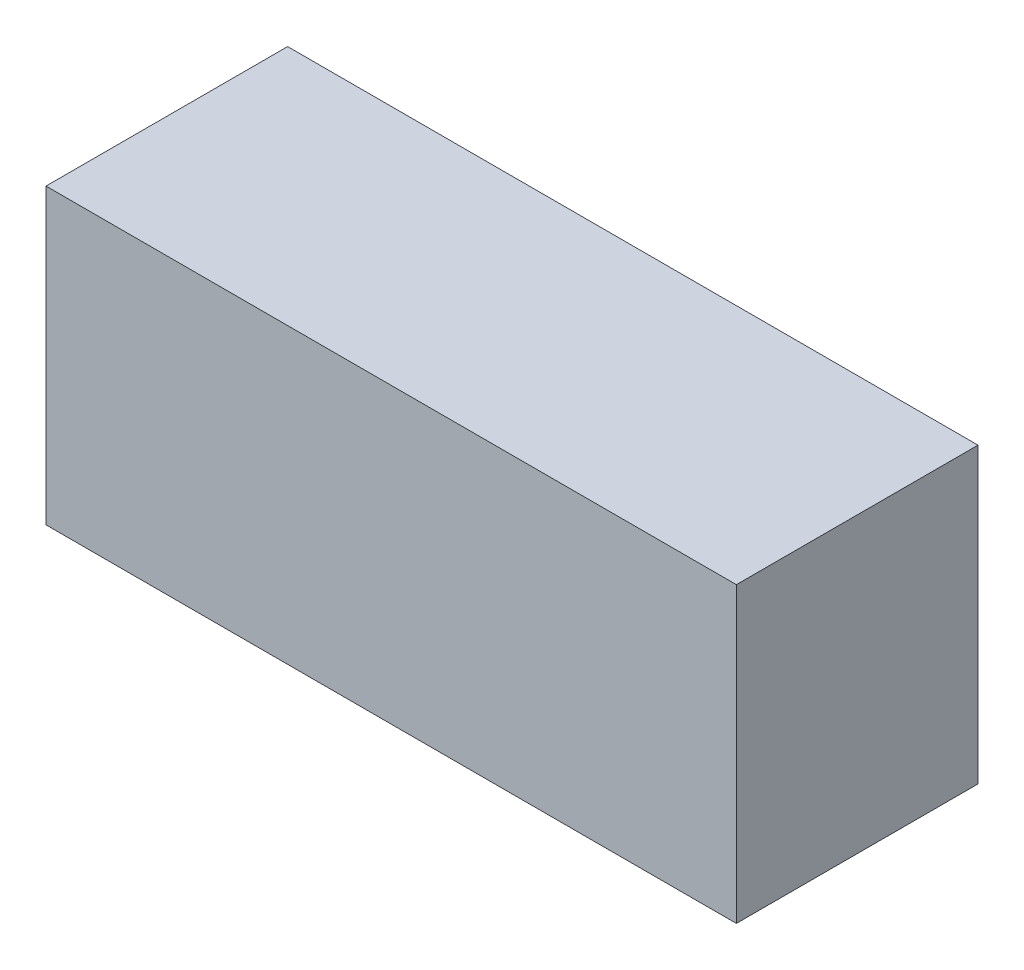
ISO-10303-21;
HEADER;
FILE_DESCRIPTION(('STEP AP214'),'2;1');
FILE_NAME('part.step','',(''),(''),'','','');
FILE_SCHEMA(('AUTOMOTIVE_DESIGN { 1 0 10303 214 1 1 1 1 }'));
ENDSEC;
DATA;
#1=APPLICATION_CONTEXT('core data for automotive mechanical design processes');
#2=APPLICATION_PROTOCOL_DEFINITION('international standard','automotive_design',2000,#1);
#3=PRODUCT_CONTEXT('',#1,'mechanical');
#4=PRODUCT('Part','Part','',(#3));
#5=PRODUCT_RELATED_PRODUCT_CATEGORY('part','',(#4));
#6=PRODUCT_DEFINITION_FORMATION('','',#4);
#7=PRODUCT_DEFINITION_CONTEXT('part definition',#1,'design');
#8=PRODUCT_DEFINITION('design','',#6,#7);
#9=PRODUCT_DEFINITION_SHAPE('','',#8);
#10=(LENGTH_UNIT() NAMED_UNIT(*) SI_UNIT(.MILLI.,.METRE.));
#11=(NAMED_UNIT(*) PLANE_ANGLE_UNIT() SI_UNIT($,.RADIAN.));
#12=(NAMED_UNIT(*) SI_UNIT($,.STERADIAN.) SOLID_ANGLE_UNIT());
#13=UNCERTAINTY_MEASURE_WITH_UNIT(LENGTH_MEASURE(1.E-05),#10,'distance_accuracy_value','');
#14=(GEOMETRIC_REPRESENTATION_CONTEXT(3) GLOBAL_UNCERTAINTY_ASSIGNED_CONTEXT((#13)) GLOBAL_UNIT_ASSIGNED_CONTEXT((#10,
#11,#12)) REPRESENTATION_CONTEXT('',''));
#15=CARTESIAN_POINT('',(0.,0.,0.));
#16=DIRECTION('',(0.,0.,1.));
#17=DIRECTION('',(1.,0.,0.));
#18=AXIS2_PLACEMENT_3D('',#15,#16,#17);
#19=CARTESIAN_POINT('',(0.,0.,140.));
#20=DIRECTION('',(1.,0.,0.));
#21=DIRECTION('',(0.,0.,-1.));
#22=AXIS2_PLACEMENT_3D('',#19,#20,#21);
#23=PLANE('',#22);
#24=DIRECTION('',(0.,-1.,0.));
#25=VECTOR('',#24,1.);
#26=CARTESIAN_POINT('',(0.,0.,0.));
#27=LINE('',#26,#25);
#28=CARTESIAN_POINT('',(0.,170.,0.));
#29=VERTEX_POINT('',#28);
#30=CARTESIAN_POINT('',(0.,0.,0.));
#31=VERTEX_POINT('',#30);
#32=EDGE_CURVE('E98',#29,#31,#27,.T.);
#33=ORIENTED_EDGE('',*,*,#32,.T.);
#34=DIRECTION('',(0.,0.,-1.));
#35=VECTOR('',#34,1.);
#36=CARTESIAN_POINT('',(0.,0.,140.));
#37=LINE('',#36,#35);
#38=CARTESIAN_POINT('',(0.,0.,140.));
#39=VERTEX_POINT('',#38);
#40=EDGE_CURVE('E11',#39,#31,#37,.T.);
#41=ORIENTED_EDGE('',*,*,#40,.F.);
#42=DIRECTION('',(0.,-1.,0.));
#43=VECTOR('',#42,1.);
#44=CARTESIAN_POINT('',(0.,0.,140.));
#45=LINE('',#44,#43);
#46=CARTESIAN_POINT('',(0.,170.,140.));
#47=VERTEX_POINT('',#46);
#48=EDGE_CURVE('E86',#47,#39,#45,.T.);
#49=ORIENTED_EDGE('',*,*,#48,.F.);
#50=DIRECTION('',(0.,0.,-1.));
#51=VECTOR('',#50,1.);
#52=CARTESIAN_POINT('',(0.,170.,140.));
#53=LINE('',#52,#51);
#54=EDGE_CURVE('E94',#47,#29,#53,.T.);
#55=ORIENTED_EDGE('',*,*,#54,.T.);
#56=EDGE_LOOP('',(#33,#41,#49,#55));
#57=FACE_BOUND('',#56,.T.);
#58=ADVANCED_FACE('F35',(#57),#23,.F.);
#59=CARTESIAN_POINT('',(0.,0.,140.));
#60=DIRECTION('',(0.,1.,0.));
#61=DIRECTION('',(0.,0.,1.));
#62=AXIS2_PLACEMENT_3D('',#59,#60,#61);
#63=PLANE('',#62);
#64=DIRECTION('',(1.,0.,0.));
#65=VECTOR('',#64,1.);
#66=CARTESIAN_POINT('',(0.,0.,0.));
#67=LINE('',#66,#65);
#68=CARTESIAN_POINT('',(400.,0.,0.));
#69=VERTEX_POINT('',#68);
#70=EDGE_CURVE('E90',#31,#69,#67,.T.);
#71=ORIENTED_EDGE('',*,*,#70,.T.);
#72=DIRECTION('',(0.,0.,-1.));
#73=VECTOR('',#72,1.);
#74=CARTESIAN_POINT('',(400.,0.,140.));
#75=LINE('',#74,#73);
#76=CARTESIAN_POINT('',(400.,0.,140.));
#77=VERTEX_POINT('',#76);
#78=EDGE_CURVE('E43',#77,#69,#75,.T.);
#79=ORIENTED_EDGE('',*,*,#78,.F.);
#80=DIRECTION('',(1.,0.,0.));
#81=VECTOR('',#80,1.);
#82=CARTESIAN_POINT('',(0.,0.,140.));
#83=LINE('',#82,#81);
#84=EDGE_CURVE('E81',#39,#77,#83,.T.);
#85=ORIENTED_EDGE('',*,*,#84,.F.);
#86=ORIENTED_EDGE('',*,*,#40,.T.);
#87=EDGE_LOOP('',(#71,#79,#85,#86));
#88=FACE_BOUND('',#87,.T.);
#89=ADVANCED_FACE('F89',(#88),#63,.F.);
#90=CARTESIAN_POINT('',(400.,0.,140.));
#91=DIRECTION('',(-1.,0.,0.));
#92=DIRECTION('',(0.,-1.,0.));
#93=AXIS2_PLACEMENT_3D('',#90,#91,#92);
#94=PLANE('',#93);
#95=DIRECTION('',(0.,1.,0.));
#96=VECTOR('',#95,1.);
#97=CARTESIAN_POINT('',(400.,0.,0.));
#98=LINE('',#97,#96);
#99=CARTESIAN_POINT('',(400.,170.,0.));
#100=VERTEX_POINT('',#99);
#101=EDGE_CURVE('E68',#69,#100,#98,.T.);
#102=ORIENTED_EDGE('',*,*,#101,.T.);
#103=DIRECTION('',(0.,0.,-1.));
#104=VECTOR('',#103,1.);
#105=CARTESIAN_POINT('',(400.,170.,140.));
#106=LINE('',#105,#104);
#107=CARTESIAN_POINT('',(400.,170.,140.));
#108=VERTEX_POINT('',#107);
#109=EDGE_CURVE('E91',#108,#100,#106,.T.);
#110=ORIENTED_EDGE('',*,*,#109,.F.);
#111=DIRECTION('',(0.,1.,0.));
#112=VECTOR('',#111,1.);
#113=CARTESIAN_POINT('',(400.,0.,140.));
#114=LINE('',#113,#112);
#115=EDGE_CURVE('E84',#77,#108,#114,.T.);
#116=ORIENTED_EDGE('',*,*,#115,.F.);
#117=ORIENTED_EDGE('',*,*,#78,.T.);
#118=EDGE_LOOP('',(#102,#110,#116,#117));
#119=FACE_BOUND('',#118,.T.);
#120=ADVANCED_FACE('F92',(#119),#94,.F.);
#121=CARTESIAN_POINT('',(0.,170.,140.));
#122=DIRECTION('',(0.,-1.,0.));
#123=DIRECTION('',(0.,0.,-1.));
#124=AXIS2_PLACEMENT_3D('',#121,#122,#123);
#125=PLANE('',#124);
#126=DIRECTION('',(-1.,0.,0.));
#127=VECTOR('',#126,1.);
#128=CARTESIAN_POINT('',(0.,170.,0.));
#129=LINE('',#128,#127);
#130=EDGE_CURVE('E74',#100,#29,#129,.T.);
#131=ORIENTED_EDGE('',*,*,#130,.T.);
#132=ORIENTED_EDGE('',*,*,#54,.F.);
#133=DIRECTION('',(-1.,0.,0.));
#134=VECTOR('',#133,1.);
#135=CARTESIAN_POINT('',(0.,170.,140.));
#136=LINE('',#135,#134);
#137=EDGE_CURVE('E51',#108,#47,#136,.T.);
#138=ORIENTED_EDGE('',*,*,#137,.F.);
#139=ORIENTED_EDGE('',*,*,#109,.T.);
#140=EDGE_LOOP('',(#131,#132,#138,#139));
#141=FACE_BOUND('',#140,.T.);
#142=ADVANCED_FACE('F105',(#141),#125,.F.);
#143=CARTESIAN_POINT('',(0.,0.,140.));
#144=DIRECTION('',(0.,0.,-1.));
#145=DIRECTION('',(-1.,0.,0.));
#146=AXIS2_PLACEMENT_3D('',#143,#144,#145);
#147=PLANE('',#146);
#148=ORIENTED_EDGE('',*,*,#48,.T.);
#149=ORIENTED_EDGE('',*,*,#84,.T.);
#150=ORIENTED_EDGE('',*,*,#115,.T.);
#151=ORIENTED_EDGE('',*,*,#137,.T.);
#152=EDGE_LOOP('',(#148,#149,#150,#151));
#153=FACE_BOUND('',#152,.T.);
#154=ADVANCED_FACE('F82',(#153),#147,.F.);
#155=CARTESIAN_POINT('',(0.,0.,0.));
#156=DIRECTION('',(0.,0.,-1.));
#157=DIRECTION('',(-1.,0.,0.));
#158=AXIS2_PLACEMENT_3D('',#155,#156,#157);
#159=PLANE('',#158);
#160=ORIENTED_EDGE('',*,*,#32,.F.);
#161=ORIENTED_EDGE('',*,*,#130,.F.);
#162=ORIENTED_EDGE('',*,*,#101,.F.);
#163=ORIENTED_EDGE('',*,*,#70,.F.);
#164=EDGE_LOOP('',(#160,#161,#162,#163));
#165=FACE_BOUND('',#164,.T.);
#166=ADVANCED_FACE('F108',(#165),#159,.T.);
#167=CLOSED_SHELL('',(#58,#89,#120,#142,#154,#166));
#168=MANIFOLD_SOLID_BREP('B2',#167);
#169=ADVANCED_BREP_SHAPE_REPRESENTATION('',(#18,#168),#14);
#170=SHAPE_DEFINITION_REPRESENTATION(#9,#169);
ENDSEC;
END-ISO-10303-21;
